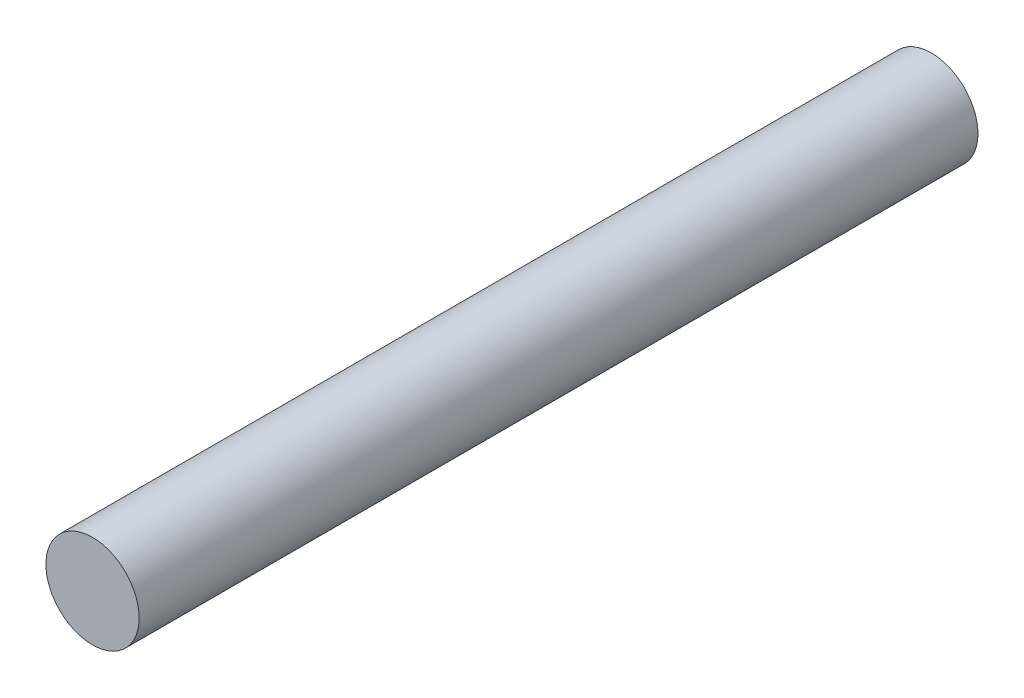
ISO-10303-21;
HEADER;
FILE_DESCRIPTION(('STEP AP214'),'2;1');
FILE_NAME('part.step','',(''),(''),'','','');
FILE_SCHEMA(('AUTOMOTIVE_DESIGN { 1 0 10303 214 1 1 1 1 }'));
ENDSEC;
DATA;
#1=APPLICATION_CONTEXT('core data for automotive mechanical design processes');
#2=APPLICATION_PROTOCOL_DEFINITION('international standard','automotive_design',2000,#1);
#3=PRODUCT_CONTEXT('',#1,'mechanical');
#4=PRODUCT('Part','Part','',(#3));
#5=PRODUCT_RELATED_PRODUCT_CATEGORY('part','',(#4));
#6=PRODUCT_DEFINITION_FORMATION('','',#4);
#7=PRODUCT_DEFINITION_CONTEXT('part definition',#1,'design');
#8=PRODUCT_DEFINITION('design','',#6,#7);
#9=PRODUCT_DEFINITION_SHAPE('','',#8);
#10=(LENGTH_UNIT() NAMED_UNIT(*) SI_UNIT(.MILLI.,.METRE.));
#11=(NAMED_UNIT(*) PLANE_ANGLE_UNIT() SI_UNIT($,.RADIAN.));
#12=(NAMED_UNIT(*) SI_UNIT($,.STERADIAN.) SOLID_ANGLE_UNIT());
#13=UNCERTAINTY_MEASURE_WITH_UNIT(LENGTH_MEASURE(1.E-05),#10,'distance_accuracy_value','');
#14=(GEOMETRIC_REPRESENTATION_CONTEXT(3) GLOBAL_UNCERTAINTY_ASSIGNED_CONTEXT((#13)) GLOBAL_UNIT_ASSIGNED_CONTEXT((#10,
#11,#12)) REPRESENTATION_CONTEXT('',''));
#15=CARTESIAN_POINT('',(0.,0.,0.));
#16=DIRECTION('',(0.,0.,1.));
#17=DIRECTION('',(1.,0.,0.));
#18=AXIS2_PLACEMENT_3D('',#15,#16,#17);
#19=CARTESIAN_POINT('',(0.,0.,45.));
#20=DIRECTION('',(0.,0.,-1.));
#21=DIRECTION('',(-1.,0.,0.));
#22=AXIS2_PLACEMENT_3D('',#19,#20,#21);
#23=CYLINDRICAL_SURFACE('',#22,2.5);
#24=CARTESIAN_POINT('',(0.,0.,45.));
#25=DIRECTION('',(0.,0.,1.));
#26=DIRECTION('',(1.,0.,0.));
#27=AXIS2_PLACEMENT_3D('',#24,#25,#26);
#28=CIRCLE('',#27,2.5);
#29=CARTESIAN_POINT('',(2.5,0.,45.));
#30=VERTEX_POINT('',#29);
#31=EDGE_CURVE('E10',#30,#30,#28,.T.);
#32=ORIENTED_EDGE('',*,*,#31,.F.);
#33=EDGE_LOOP('',(#32));
#34=FACE_BOUND('',#33,.T.);
#35=CARTESIAN_POINT('',(0.,0.,0.));
#36=DIRECTION('',(0.,0.,1.));
#37=DIRECTION('',(1.,0.,0.));
#38=AXIS2_PLACEMENT_3D('',#35,#36,#37);
#39=CIRCLE('',#38,2.5);
#40=CARTESIAN_POINT('',(2.5,0.,0.));
#41=VERTEX_POINT('',#40);
#42=EDGE_CURVE('E40',#41,#41,#39,.T.);
#43=ORIENTED_EDGE('',*,*,#42,.T.);
#44=EDGE_LOOP('',(#43));
#45=FACE_BOUND('',#44,.T.);
#46=ADVANCED_FACE('F37',(#34,#45),#23,.T.);
#47=CARTESIAN_POINT('',(0.,0.,45.));
#48=DIRECTION('',(0.,0.,1.));
#49=DIRECTION('',(1.,0.,0.));
#50=AXIS2_PLACEMENT_3D('',#47,#48,#49);
#51=PLANE('',#50);
#52=ORIENTED_EDGE('',*,*,#31,.T.);
#53=EDGE_LOOP('',(#52));
#54=FACE_BOUND('',#53,.T.);
#55=ADVANCED_FACE('F54',(#54),#51,.T.);
#56=CARTESIAN_POINT('',(0.,0.,0.));
#57=DIRECTION('',(0.,0.,1.));
#58=DIRECTION('',(1.,0.,0.));
#59=AXIS2_PLACEMENT_3D('',#56,#57,#58);
#60=PLANE('',#59);
#61=ORIENTED_EDGE('',*,*,#42,.F.);
#62=EDGE_LOOP('',(#61));
#63=FACE_BOUND('',#62,.T.);
#64=ADVANCED_FACE('F52',(#63),#60,.F.);
#65=CLOSED_SHELL('',(#46,#55,#64));
#66=MANIFOLD_SOLID_BREP('B2',#65);
#67=ADVANCED_BREP_SHAPE_REPRESENTATION('',(#18,#66),#14);
#68=SHAPE_DEFINITION_REPRESENTATION(#9,#67);
ENDSEC;
END-ISO-10303-21;
